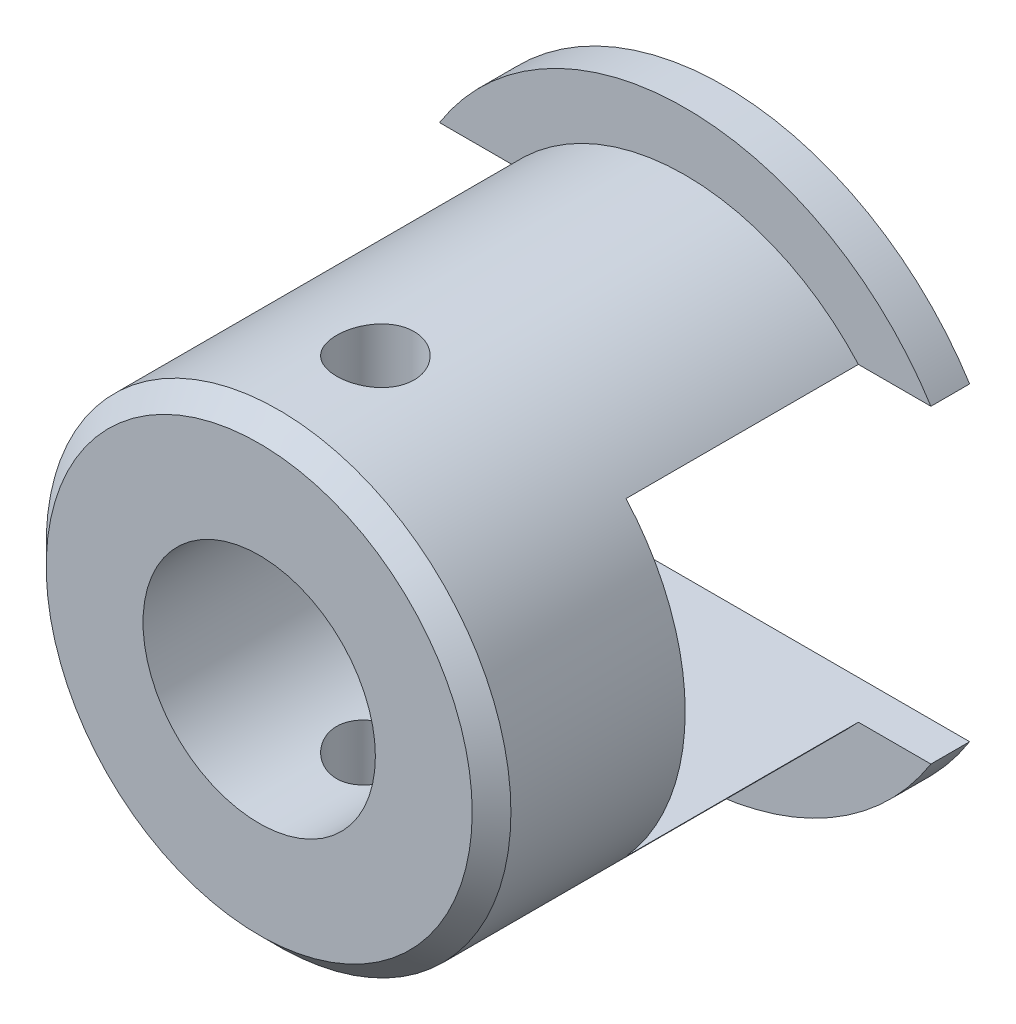
ISO-10303-21;
HEADER;
FILE_DESCRIPTION(('STEP AP214'),'2;1');
FILE_NAME('part.step','',(''),(''),'','','');
FILE_SCHEMA(('AUTOMOTIVE_DESIGN { 1 0 10303 214 1 1 1 1 }'));
ENDSEC;
DATA;
#1=APPLICATION_CONTEXT('core data for automotive mechanical design processes');
#2=APPLICATION_PROTOCOL_DEFINITION('international standard','automotive_design',2000,#1);
#3=PRODUCT_CONTEXT('',#1,'mechanical');
#4=PRODUCT('Part','Part','',(#3));
#5=PRODUCT_RELATED_PRODUCT_CATEGORY('part','',(#4));
#6=PRODUCT_DEFINITION_FORMATION('','',#4);
#7=PRODUCT_DEFINITION_CONTEXT('part definition',#1,'design');
#8=PRODUCT_DEFINITION('design','',#6,#7);
#9=PRODUCT_DEFINITION_SHAPE('','',#8);
#10=(LENGTH_UNIT() NAMED_UNIT(*) SI_UNIT(.MILLI.,.METRE.));
#11=(NAMED_UNIT(*) PLANE_ANGLE_UNIT() SI_UNIT($,.RADIAN.));
#12=(NAMED_UNIT(*) SI_UNIT($,.STERADIAN.) SOLID_ANGLE_UNIT());
#13=UNCERTAINTY_MEASURE_WITH_UNIT(LENGTH_MEASURE(1.E-05),#10,'distance_accuracy_value','');
#14=(GEOMETRIC_REPRESENTATION_CONTEXT(3) GLOBAL_UNCERTAINTY_ASSIGNED_CONTEXT((#13)) GLOBAL_UNIT_ASSIGNED_CONTEXT((#10,
#11,#12)) REPRESENTATION_CONTEXT('',''));
#15=CARTESIAN_POINT('',(0.,0.,0.));
#16=DIRECTION('',(0.,0.,1.));
#17=DIRECTION('',(1.,0.,0.));
#18=AXIS2_PLACEMENT_3D('',#15,#16,#17);
#19=CARTESIAN_POINT('',(0.,0.,1.));
#20=DIRECTION('',(0.,0.,1.));
#21=DIRECTION('',(1.,0.,0.));
#22=AXIS2_PLACEMENT_3D('',#19,#20,#21);
#23=CYLINDRICAL_SURFACE('',#22,6.);
#24=CARTESIAN_POINT('',(0.,0.,11.5));
#25=DIRECTION('',(0.,0.,1.));
#26=DIRECTION('',(1.,0.,0.));
#27=AXIS2_PLACEMENT_3D('',#24,#25,#26);
#28=CIRCLE('',#27,6.);
#29=CARTESIAN_POINT('',(6.,0.,11.5));
#30=VERTEX_POINT('',#29);
#31=EDGE_CURVE('E11',#30,#30,#28,.F.);
#32=ORIENTED_EDGE('',*,*,#31,.T.);
#33=EDGE_LOOP('',(#32));
#34=FACE_BOUND('',#33,.T.);
#35=CARTESIAN_POINT('',(0.,-6.,8.));
#36=CARTESIAN_POINT('',(-0.0557563619832847,-5.9999990446753,8.00000223557913));
#37=CARTESIAN_POINT('',(-0.111543152735527,-5.99921471165214,8.00467890998757));
#38=CARTESIAN_POINT('',(-0.221552088669216,-5.99616137976555,8.02325426350613));
#39=CARTESIAN_POINT('',(-0.275772747183698,-5.99389101569556,8.03716142276464));
#40=CARTESIAN_POINT('',(-0.381041898885056,-5.9881202729458,8.0737661794371));
#41=CARTESIAN_POINT('',(-0.432092947372759,-5.98462090063677,8.09645658625623));
#42=CARTESIAN_POINT('',(-0.529656736791177,-5.97677690832828,8.14996491682096));
#43=CARTESIAN_POINT('',(-0.576169995951436,-5.97243238501774,8.1807819109932));
#44=CARTESIAN_POINT('',(-0.663789045716671,-5.96333326983325,8.24998203352819));
#45=CARTESIAN_POINT('',(-0.704845161413986,-5.95857548725943,8.28842764585445));
#46=CARTESIAN_POINT('',(-0.779955399463971,-5.94921050750693,8.37165918738913));
#47=CARTESIAN_POINT('',(-0.814009079756388,-5.94460331985067,8.41644551658264));
#48=CARTESIAN_POINT('',(-0.874346850242053,-5.93603026303912,8.51142838647882));
#49=CARTESIAN_POINT('',(-0.9005818211444,-5.93206851636654,8.56165653472191));
#50=CARTESIAN_POINT('',(-0.944223346164487,-5.9252791591787,8.66588382572025));
#51=CARTESIAN_POINT('',(-0.961630496626245,-5.92245147205723,8.71988271347105));
#52=CARTESIAN_POINT('',(-0.986965751113923,-5.91828214737102,8.82959210994262));
#53=CARTESIAN_POINT('',(-0.99497961165416,-5.9169270739428,8.88528229460056));
#54=CARTESIAN_POINT('',(-1.00156669011595,-5.9158157557466,8.99723211075339));
#55=CARTESIAN_POINT('',(-1.0001405761556,-5.91605939782886,9.05349170166692));
#56=CARTESIAN_POINT('',(-0.98795803935846,-5.91810571545422,9.16437114451018));
#57=CARTESIAN_POINT('',(-0.977297952755909,-5.91989229327567,9.21900192141809));
#58=CARTESIAN_POINT('',(-0.947101256161378,-5.92479798084403,9.32568852713165));
#59=CARTESIAN_POINT('',(-0.927564341727896,-5.92791713629309,9.37774426755542));
#60=CARTESIAN_POINT('',(-0.880070898437565,-5.9351539173364,9.47809152937637));
#61=CARTESIAN_POINT('',(-0.852074365551885,-5.9392762684293,9.52636376243249));
#62=CARTESIAN_POINT('',(-0.788484807022972,-5.94805167366004,9.61756176021536));
#63=CARTESIAN_POINT('',(-0.752891168261713,-5.95270477061715,9.66048709298197));
#64=CARTESIAN_POINT('',(-0.67459288486362,-5.96208811151914,9.74033043432294));
#65=CARTESIAN_POINT('',(-0.63180558554925,-5.96681859692661,9.77716740741604));
#66=CARTESIAN_POINT('',(-0.540614099592658,-5.97577040558689,9.84315110506614));
#67=CARTESIAN_POINT('',(-0.492209876762568,-5.97999172555898,9.87229778007329));
#68=CARTESIAN_POINT('',(-0.391082366466683,-5.98745557157165,9.92208089085451));
#69=CARTESIAN_POINT('',(-0.338355490225864,-5.99069727362979,9.9427101677325));
#70=CARTESIAN_POINT('',(-0.230119338241092,-5.99583001205064,9.97479768609839));
#71=CARTESIAN_POINT('',(-0.174610295671786,-5.9977211614019,9.98625669478949));
#72=CARTESIAN_POINT('',(-0.0630839605206478,-5.99992451937074,9.99956854338445));
#73=CARTESIAN_POINT('',(-0.00708029486040275,-6.00025501205114,10.0015326287222));
#74=CARTESIAN_POINT('',(0.104455909155957,-5.99934989768468,9.99609546222875));
#75=CARTESIAN_POINT('',(0.159988465556817,-5.99811435089647,9.98869457074651));
#76=CARTESIAN_POINT('',(0.268662470218707,-5.99422730775281,9.96483006026581));
#77=CARTESIAN_POINT('',(0.321816347354153,-5.99158441920524,9.94842151664395));
#78=CARTESIAN_POINT('',(0.424618753944178,-5.98517785782144,9.90706619272019));
#79=CARTESIAN_POINT('',(0.474267086363889,-5.98141412204808,9.88211893294589));
#80=CARTESIAN_POINT('',(0.569132275787585,-5.97313806520963,9.82413955012129));
#81=CARTESIAN_POINT('',(0.614306100374862,-5.96861942354809,9.7910379375331));
#82=CARTESIAN_POINT('',(0.698497434201078,-5.9593538695676,9.71778507384598));
#83=CARTESIAN_POINT('',(0.737514495878635,-5.95460694068619,9.67763331068933));
#84=CARTESIAN_POINT('',(0.808697111863202,-5.94536070094338,9.59092098077143));
#85=CARTESIAN_POINT('',(0.840787504445488,-5.94086446454842,9.54429833379424));
#86=CARTESIAN_POINT('',(0.896680924117996,-5.93268611911154,9.44625881234458));
#87=CARTESIAN_POINT('',(0.920484213907931,-5.92900398426408,9.394842089909));
#88=CARTESIAN_POINT('',(0.959015332589261,-5.92289381479082,9.28888410687515));
#89=CARTESIAN_POINT('',(0.97378057301918,-5.92046061724426,9.2343567619878));
#90=CARTESIAN_POINT('',(0.993934181511312,-5.91711086734105,9.1235519483113));
#91=CARTESIAN_POINT('',(0.999323364778469,-5.91619418313089,9.06727463210718));
#92=CARTESIAN_POINT('',(1.00054914641894,-5.91598693233605,8.95531793361504));
#93=CARTESIAN_POINT('',(0.996504054450076,-5.9166762260226,8.89963984856989));
#94=CARTESIAN_POINT('',(0.979231935582741,-5.91955912581491,8.7897683007797));
#95=CARTESIAN_POINT('',(0.966004938444992,-5.92175272704486,8.73557483322325));
#96=CARTESIAN_POINT('',(0.930789795837963,-5.92738942512688,8.63025662508296));
#97=CARTESIAN_POINT('',(0.908811836240179,-5.93083106887868,8.57912839597759));
#98=CARTESIAN_POINT('',(0.856730801566366,-5.93857747568883,8.48126573232206));
#99=CARTESIAN_POINT('',(0.826627323499427,-5.9428822815536,8.43453151585115));
#100=CARTESIAN_POINT('',(0.758727553748864,-5.95193381618249,8.3461857667569));
#101=CARTESIAN_POINT('',(0.72084422543746,-5.95668518230521,8.30464159331989));
#102=CARTESIAN_POINT('',(0.638643612552093,-5.96605748944336,8.22845935821003));
#103=CARTESIAN_POINT('',(0.594324845165056,-5.97067840010619,8.19382289254473));
#104=CARTESIAN_POINT('',(0.500147667856114,-5.97930611856888,8.13222069272002));
#105=CARTESIAN_POINT('',(0.450253115013128,-5.98330846501242,8.10530958427482));
#106=CARTESIAN_POINT('',(0.346605227751593,-5.9902046704071,8.06029220615603));
#107=CARTESIAN_POINT('',(0.292855797932005,-5.99309963270993,8.04217716756812));
#108=CARTESIAN_POINT('',(0.199081324018161,-5.99682316333182,8.01919789034933));
#109=CARTESIAN_POINT('',(0.15962353211938,-5.99800810909344,8.01201021215362));
#110=CARTESIAN_POINT('',(0.0801157241279247,-5.99959686394448,8.0024105048621));
#111=CARTESIAN_POINT('',(0.0400657182433988,-6.00000068648257,7.99999839354506));
#112=CARTESIAN_POINT('',(0.,-6.,8.));
#113=B_SPLINE_CURVE_WITH_KNOTS('',3,(#35,#36,#37,#38,#39,#40,#41,#42,#43,#44,#45,#46,#47,#48,
#49,#50,#51,#52,#53,#54,#55,#56,#57,#58,#59,#60,#61,#62,#63,#64,#65,#66,#67,#68,#69,#70,#71,#72,
#73,#74,#75,#76,#77,#78,#79,#80,#81,#82,#83,#84,#85,#86,#87,#88,#89,#90,#91,#92,#93,#94,#95,#96,
#97,#98,#99,#100,#101,#102,#103,#104,#105,#106,#107,#108,#109,#110,#111,#112),.UNSPECIFIED.,.T.,
.F.,(4,2,2,2,2,2,2,2,2,2,2,2,2,2,2,2,2,2,2,2,2,2,2,2,2,2,2,2,2,2,2,2,2,2,2,2,2,2,4),(0.,
0.167122633975404,0.334399018278169,0.501538746810108,0.668659365069917,0.837209964249329,
1.00577120067943,1.17537008329536,1.34495750750473,1.5129843084137,1.68099921728355,
1.84728208704163,2.01357066010152,2.18065822653023,2.3477592827223,2.51693107964531,
2.68610396654339,2.85541875566361,3.0247193780846,3.19203153396559,3.35933725214344,
3.52563122802566,3.69193454330427,3.8597073025081,4.02749225221713,4.19701528803048,
4.36653294950377,4.53534408936709,4.70414055114647,4.8708316380908,5.03752218475253,
5.20401927290489,5.37052462011735,5.53900553677357,5.70752533551589,5.8772089264288,
6.04672300852029,6.16681699265608,6.28690890910787),.UNSPECIFIED.);
#114=CARTESIAN_POINT('',(0.,-6.,8.));
#115=VERTEX_POINT('',#114);
#116=EDGE_CURVE('E153',#115,#115,#113,.T.);
#117=ORIENTED_EDGE('',*,*,#116,.T.);
#118=EDGE_LOOP('',(#117));
#119=FACE_BOUND('',#118,.T.);
#120=DIRECTION('',(0.,0.,1.));
#121=VECTOR('',#120,1.);
#122=CARTESIAN_POINT('',(-4.47213595499958,-4.,1.));
#123=LINE('',#122,#121);
#124=CARTESIAN_POINT('',(-4.47213595499958,-4.,1.));
#125=VERTEX_POINT('',#124);
#126=CARTESIAN_POINT('',(-4.47213595499958,-4.,7.));
#127=VERTEX_POINT('',#126);
#128=EDGE_CURVE('E112',#125,#127,#123,.T.);
#129=ORIENTED_EDGE('',*,*,#128,.F.);
#130=CARTESIAN_POINT('',(0.,0.,1.));
#131=DIRECTION('',(0.,0.,1.));
#132=DIRECTION('',(1.,0.,0.));
#133=AXIS2_PLACEMENT_3D('',#130,#131,#132);
#134=CIRCLE('',#133,6.);
#135=CARTESIAN_POINT('',(4.47213595499958,-4.,1.));
#136=VERTEX_POINT('',#135);
#137=EDGE_CURVE('E117',#125,#136,#134,.T.);
#138=ORIENTED_EDGE('',*,*,#137,.T.);
#139=DIRECTION('',(0.,0.,1.));
#140=VECTOR('',#139,1.);
#141=CARTESIAN_POINT('',(4.47213595499958,-4.,1.));
#142=LINE('',#141,#140);
#143=CARTESIAN_POINT('',(4.47213595499958,-4.,7.));
#144=VERTEX_POINT('',#143);
#145=EDGE_CURVE('E110',#144,#136,#142,.F.);
#146=ORIENTED_EDGE('',*,*,#145,.F.);
#147=CARTESIAN_POINT('',(0.,0.,7.));
#148=DIRECTION('',(0.,0.,1.));
#149=DIRECTION('',(1.,0.,0.));
#150=AXIS2_PLACEMENT_3D('',#147,#148,#149);
#151=CIRCLE('',#150,6.);
#152=CARTESIAN_POINT('',(4.47213595499958,4.,7.));
#153=VERTEX_POINT('',#152);
#154=EDGE_CURVE('E97',#153,#144,#151,.F.);
#155=ORIENTED_EDGE('',*,*,#154,.F.);
#156=DIRECTION('',(0.,0.,1.));
#157=VECTOR('',#156,1.);
#158=CARTESIAN_POINT('',(4.47213595499958,4.,1.));
#159=LINE('',#158,#157);
#160=CARTESIAN_POINT('',(4.47213595499958,4.,1.));
#161=VERTEX_POINT('',#160);
#162=EDGE_CURVE('E119',#161,#153,#159,.T.);
#163=ORIENTED_EDGE('',*,*,#162,.F.);
#164=CARTESIAN_POINT('',(-4.47213595499958,4.,1.));
#165=VERTEX_POINT('',#164);
#166=EDGE_CURVE('E206',#161,#165,#134,.T.);
#167=ORIENTED_EDGE('',*,*,#166,.T.);
#168=DIRECTION('',(0.,0.,1.));
#169=VECTOR('',#168,1.);
#170=CARTESIAN_POINT('',(-4.47213595499958,4.,1.));
#171=LINE('',#170,#169);
#172=CARTESIAN_POINT('',(-4.47213595499958,4.,7.));
#173=VERTEX_POINT('',#172);
#174=EDGE_CURVE('E118',#173,#165,#171,.F.);
#175=ORIENTED_EDGE('',*,*,#174,.F.);
#176=EDGE_CURVE('E106',#127,#173,#151,.F.);
#177=ORIENTED_EDGE('',*,*,#176,.F.);
#178=EDGE_LOOP('',(#129,#138,#146,#155,#163,#167,#175,#177));
#179=FACE_BOUND('',#178,.T.);
#180=CARTESIAN_POINT('',(0.,6.,8.));
#181=CARTESIAN_POINT('',(0.0557563619832869,5.9999990446753,8.00000223557913));
#182=CARTESIAN_POINT('',(0.111543152735529,5.99921471165214,8.00467890998757));
#183=CARTESIAN_POINT('',(0.221552088669218,5.99616137976555,8.02325426350613));
#184=CARTESIAN_POINT('',(0.2757727471837,5.99389101569556,8.03716142276464));
#185=CARTESIAN_POINT('',(0.381041898885059,5.9881202729458,8.0737661794371));
#186=CARTESIAN_POINT('',(0.432092947372762,5.98462090063677,8.09645658625623));
#187=CARTESIAN_POINT('',(0.52965673679118,5.97677690832828,8.14996491682096));
#188=CARTESIAN_POINT('',(0.576169995951438,5.97243238501774,8.1807819109932));
#189=CARTESIAN_POINT('',(0.663789045716674,5.96333326983325,8.24998203352819));
#190=CARTESIAN_POINT('',(0.704845161413989,5.95857548725943,8.28842764585445));
#191=CARTESIAN_POINT('',(0.779955399463973,5.94921050750693,8.37165918738913));
#192=CARTESIAN_POINT('',(0.81400907975639,5.94460331985067,8.41644551658264));
#193=CARTESIAN_POINT('',(0.874346850242055,5.93603026303912,8.51142838647882));
#194=CARTESIAN_POINT('',(0.900581821144402,5.93206851636655,8.56165653472191));
#195=CARTESIAN_POINT('',(0.944223346164489,5.9252791591787,8.66588382572025));
#196=CARTESIAN_POINT('',(0.961630496626247,5.92245147205723,8.71988271347105));
#197=CARTESIAN_POINT('',(0.986965751113925,5.91828214737102,8.82959210994262));
#198=CARTESIAN_POINT('',(0.994979611654162,5.9169270739428,8.88528229460056));
#199=CARTESIAN_POINT('',(1.00156669011595,5.9158157557466,8.99723211075339));
#200=CARTESIAN_POINT('',(1.0001405761556,5.91605939782886,9.05349170166692));
#201=CARTESIAN_POINT('',(0.987958039358462,5.91810571545422,9.16437114451018));
#202=CARTESIAN_POINT('',(0.977297952755911,5.91989229327567,9.21900192141809));
#203=CARTESIAN_POINT('',(0.94710125616138,5.92479798084403,9.32568852713165));
#204=CARTESIAN_POINT('',(0.927564341727898,5.92791713629309,9.37774426755542));
#205=CARTESIAN_POINT('',(0.880070898437567,5.9351539173364,9.47809152937637));
#206=CARTESIAN_POINT('',(0.852074365551887,5.9392762684293,9.52636376243249));
#207=CARTESIAN_POINT('',(0.788484807022975,5.94805167366004,9.61756176021536));
#208=CARTESIAN_POINT('',(0.752891168261716,5.95270477061714,9.66048709298197));
#209=CARTESIAN_POINT('',(0.674592884863622,5.96208811151914,9.74033043432294));
#210=CARTESIAN_POINT('',(0.631805585549252,5.96681859692661,9.77716740741604));
#211=CARTESIAN_POINT('',(0.54061409959266,5.97577040558689,9.84315110506614));
#212=CARTESIAN_POINT('',(0.49220987676257,5.97999172555898,9.87229778007329));
#213=CARTESIAN_POINT('',(0.391082366466685,5.98745557157165,9.92208089085451));
#214=CARTESIAN_POINT('',(0.338355490225865,5.99069727362979,9.9427101677325));
#215=CARTESIAN_POINT('',(0.230119338241093,5.99583001205064,9.97479768609839));
#216=CARTESIAN_POINT('',(0.174610295671788,5.9977211614019,9.98625669478949));
#217=CARTESIAN_POINT('',(0.0630839605206501,5.99992451937074,9.99956854338446));
#218=CARTESIAN_POINT('',(0.00708029486040501,6.00025501205114,10.0015326287222));
#219=CARTESIAN_POINT('',(-0.104455909155954,5.99934989768468,9.99609546222875));
#220=CARTESIAN_POINT('',(-0.159988465556815,5.99811435089647,9.98869457074651));
#221=CARTESIAN_POINT('',(-0.268662470218705,5.99422730775281,9.96483006026581));
#222=CARTESIAN_POINT('',(-0.321816347354151,5.99158441920525,9.94842151664395));
#223=CARTESIAN_POINT('',(-0.424618753944176,5.98517785782144,9.90706619272019));
#224=CARTESIAN_POINT('',(-0.474267086363887,5.98141412204808,9.88211893294589));
#225=CARTESIAN_POINT('',(-0.569132275787582,5.97313806520963,9.82413955012129));
#226=CARTESIAN_POINT('',(-0.614306100374859,5.96861942354809,9.7910379375331));
#227=CARTESIAN_POINT('',(-0.698497434201075,5.9593538695676,9.71778507384598));
#228=CARTESIAN_POINT('',(-0.737514495878633,5.95460694068619,9.67763331068933));
#229=CARTESIAN_POINT('',(-0.8086971118632,5.94536070094338,9.59092098077143));
#230=CARTESIAN_POINT('',(-0.840787504445485,5.94086446454842,9.54429833379424));
#231=CARTESIAN_POINT('',(-0.896680924117993,5.93268611911154,9.44625881234458));
#232=CARTESIAN_POINT('',(-0.920484213907928,5.92900398426408,9.394842089909));
#233=CARTESIAN_POINT('',(-0.959015332589259,5.92289381479082,9.28888410687515));
#234=CARTESIAN_POINT('',(-0.973780573019178,5.92046061724426,9.2343567619878));
#235=CARTESIAN_POINT('',(-0.99393418151131,5.91711086734104,9.1235519483113));
#236=CARTESIAN_POINT('',(-0.999323364778466,5.91619418313089,9.06727463210718));
#237=CARTESIAN_POINT('',(-1.00054914641894,5.91598693233605,8.95531793361504));
#238=CARTESIAN_POINT('',(-0.996504054450074,5.9166762260226,8.89963984856989));
#239=CARTESIAN_POINT('',(-0.979231935582739,5.91955912581491,8.7897683007797));
#240=CARTESIAN_POINT('',(-0.96600493844499,5.92175272704486,8.73557483322325));
#241=CARTESIAN_POINT('',(-0.93078979583796,5.92738942512688,8.63025662508296));
#242=CARTESIAN_POINT('',(-0.908811836240177,5.93083106887868,8.57912839597759));
#243=CARTESIAN_POINT('',(-0.856730801566364,5.93857747568883,8.48126573232206));
#244=CARTESIAN_POINT('',(-0.826627323499425,5.9428822815536,8.43453151585115));
#245=CARTESIAN_POINT('',(-0.758727553748861,5.95193381618249,8.3461857667569));
#246=CARTESIAN_POINT('',(-0.720844225437458,5.95668518230521,8.30464159331989));
#247=CARTESIAN_POINT('',(-0.638643612552091,5.96605748944337,8.22845935821003));
#248=CARTESIAN_POINT('',(-0.594324845165054,5.97067840010619,8.19382289254473));
#249=CARTESIAN_POINT('',(-0.500147667856112,5.97930611856888,8.13222069272002));
#250=CARTESIAN_POINT('',(-0.450253115013126,5.98330846501242,8.10530958427482));
#251=CARTESIAN_POINT('',(-0.346605227751591,5.9902046704071,8.06029220615603));
#252=CARTESIAN_POINT('',(-0.292855797932003,5.99309963270993,8.04217716756812));
#253=CARTESIAN_POINT('',(-0.199081324018159,5.99682316333182,8.01919789034933));
#254=CARTESIAN_POINT('',(-0.159623532119378,5.99800810909344,8.01201021215362));
#255=CARTESIAN_POINT('',(-0.0801157241279224,5.99959686394448,8.0024105048621));
#256=CARTESIAN_POINT('',(-0.0400657182433965,6.00000068648257,7.99999839354506));
#257=CARTESIAN_POINT('',(0.,6.,8.));
#258=B_SPLINE_CURVE_WITH_KNOTS('',3,(#180,#181,#182,#183,#184,#185,#186,#187,#188,#189,#190,
#191,#192,#193,#194,#195,#196,#197,#198,#199,#200,#201,#202,#203,#204,#205,#206,#207,#208,#209,
#210,#211,#212,#213,#214,#215,#216,#217,#218,#219,#220,#221,#222,#223,#224,#225,#226,#227,#228,
#229,#230,#231,#232,#233,#234,#235,#236,#237,#238,#239,#240,#241,#242,#243,#244,#245,#246,#247,
#248,#249,#250,#251,#252,#253,#254,#255,#256,#257),.UNSPECIFIED.,.T.,.F.,(4,2,2,2,2,2,2,2,2,2,2,
2,2,2,2,2,2,2,2,2,2,2,2,2,2,2,2,2,2,2,2,2,2,2,2,2,2,2,4),(0.,0.167122633975404,
0.334399018278169,0.501538746810109,0.668659365069917,0.837209964249329,1.00577120067943,
1.17537008329536,1.34495750750473,1.5129843084137,1.68099921728355,1.84728208704163,
2.01357066010152,2.18065822653023,2.3477592827223,2.51693107964531,2.68610396654339,
2.85541875566362,3.0247193780846,3.19203153396559,3.35933725214344,3.52563122802566,
3.69193454330427,3.8597073025081,4.02749225221713,4.19701528803048,4.36653294950378,
4.53534408936709,4.70414055114647,4.8708316380908,5.03752218475253,5.20401927290489,
5.37052462011735,5.53900553677357,5.7075253355159,5.8772089264288,6.04672300852029,
6.16681699265608,6.28690890910788),.UNSPECIFIED.);
#259=CARTESIAN_POINT('',(0.,6.,8.));
#260=VERTEX_POINT('',#259);
#261=EDGE_CURVE('E157',#260,#260,#258,.T.);
#262=ORIENTED_EDGE('',*,*,#261,.T.);
#263=EDGE_LOOP('',(#262));
#264=FACE_BOUND('',#263,.T.);
#265=ADVANCED_FACE('F33',(#34,#119,#179,#264),#23,.T.);
#266=CARTESIAN_POINT('',(0.,0.,7.));
#267=DIRECTION('',(0.,0.,1.));
#268=DIRECTION('',(1.,0.,0.));
#269=AXIS2_PLACEMENT_3D('',#266,#267,#268);
#270=CYLINDRICAL_SURFACE('',#269,3.);
#271=CARTESIAN_POINT('',(0.,0.,7.));
#272=DIRECTION('',(0.,0.,1.));
#273=DIRECTION('',(1.,0.,0.));
#274=AXIS2_PLACEMENT_3D('',#271,#272,#273);
#275=CIRCLE('',#274,3.);
#276=CARTESIAN_POINT('',(3.,0.,7.));
#277=VERTEX_POINT('',#276);
#278=EDGE_CURVE('E107',#277,#277,#275,.F.);
#279=ORIENTED_EDGE('',*,*,#278,.T.);
#280=EDGE_LOOP('',(#279));
#281=FACE_BOUND('',#280,.T.);
#282=CARTESIAN_POINT('',(0.,0.,12.));
#283=DIRECTION('',(0.,0.,1.));
#284=DIRECTION('',(1.,0.,0.));
#285=AXIS2_PLACEMENT_3D('',#282,#283,#284);
#286=CIRCLE('',#285,3.);
#287=CARTESIAN_POINT('',(3.,0.,12.));
#288=VERTEX_POINT('',#287);
#289=EDGE_CURVE('E235',#288,#288,#286,.T.);
#290=ORIENTED_EDGE('',*,*,#289,.T.);
#291=EDGE_LOOP('',(#290));
#292=FACE_BOUND('',#291,.T.);
#293=CARTESIAN_POINT('',(0.,-3.,8.));
#294=CARTESIAN_POINT('',(-0.0545633628867222,-3.00000015300943,7.99999974626836));
#295=CARTESIAN_POINT('',(-0.109125194538549,-2.99849769507545,8.00448026612722));
#296=CARTESIAN_POINT('',(-0.216641760872971,-2.99265210203281,8.02222910881722));
#297=CARTESIAN_POINT('',(-0.269596328118817,-2.98830867202153,8.03549834394892));
#298=CARTESIAN_POINT('',(-0.372332789501776,-2.97725307906443,8.07031924338405));
#299=CARTESIAN_POINT('',(-0.422119825886034,-2.97054487730853,8.09185706245927));
#300=CARTESIAN_POINT('',(-0.517374936805324,-2.95544445717342,8.14254117283835));
#301=CARTESIAN_POINT('',(-0.562842156958705,-2.94705190667778,8.1716889650026));
#302=CARTESIAN_POINT('',(-0.649741675022265,-2.92914094443005,8.23782580485875));
#303=CARTESIAN_POINT('',(-0.691003700298309,-2.91959556463785,8.2750312342605));
#304=CARTESIAN_POINT('',(-0.766832692702083,-2.90060314783122,8.35576715470657));
#305=CARTESIAN_POINT('',(-0.801398185489462,-2.89115613290549,8.39929903492851));
#306=CARTESIAN_POINT('',(-0.863824942227859,-2.87313332477274,8.49298511519646));
#307=CARTESIAN_POINT('',(-0.891464858221032,-2.86459039275688,8.54329373973212));
#308=CARTESIAN_POINT('',(-0.937818873877721,-2.84975305418601,8.64817609445855));
#309=CARTESIAN_POINT('',(-0.956535697386765,-2.84345796160746,8.70274851716275));
#310=CARTESIAN_POINT('',(-0.983873461509163,-2.83411303269377,8.81267322149671));
#311=CARTESIAN_POINT('',(-0.992813448271769,-2.83096095769611,8.86793720848907));
#312=CARTESIAN_POINT('',(-1.00134112333448,-2.82795656629508,8.97926375415588));
#313=CARTESIAN_POINT('',(-1.00093170160472,-2.8281032302273,9.03532606070919));
#314=CARTESIAN_POINT('',(-0.991019903703418,-2.8315901500818,9.14393663044402));
#315=CARTESIAN_POINT('',(-0.981933913166994,-2.83478415867533,9.19652840291902));
#316=CARTESIAN_POINT('',(-0.955606162849416,-2.84376657724551,9.29939341960684));
#317=CARTESIAN_POINT('',(-0.93836342659187,-2.84955529784108,9.34966638543507));
#318=CARTESIAN_POINT('',(-0.89593905806021,-2.86317911131249,9.44741274959148));
#319=CARTESIAN_POINT('',(-0.870634048707261,-2.87104565793117,9.49482802546953));
#320=CARTESIAN_POINT('',(-0.812889106303138,-2.88792558575726,9.58487090827973));
#321=CARTESIAN_POINT('',(-0.780447112364004,-2.89693929790464,9.62749712693338));
#322=CARTESIAN_POINT('',(-0.707349332682236,-2.91567329167741,9.70909159816078));
#323=CARTESIAN_POINT('',(-0.66635315007631,-2.92540589354843,9.74775269450907));
#324=CARTESIAN_POINT('',(-0.578339569970062,-2.94406938387037,9.8177312666634));
#325=CARTESIAN_POINT('',(-0.531321595660813,-2.95300019538067,9.8490480381645));
#326=CARTESIAN_POINT('',(-0.431947613046266,-2.96917107937794,9.90369630023507));
#327=CARTESIAN_POINT('',(-0.379543276416335,-2.9763935000804,9.92694549134073));
#328=CARTESIAN_POINT('',(-0.271269083364506,-2.98820567144435,9.96420317395571));
#329=CARTESIAN_POINT('',(-0.215400438154953,-2.99279633654879,9.97821487542344));
#330=CARTESIAN_POINT('',(-0.104383829529303,-2.99867627071441,9.99605566602236));
#331=CARTESIAN_POINT('',(-0.0493095998648441,-3.00010001833731,10.0002998091727));
#332=CARTESIAN_POINT('',(0.0607750699602378,-2.99988902694825,9.99966732640153));
#333=CARTESIAN_POINT('',(0.115785519319649,-2.99825480419352,9.99479224002013));
#334=CARTESIAN_POINT('',(0.222519866304261,-2.99220024717114,9.97638809226404));
#335=CARTESIAN_POINT('',(0.274292806834858,-2.98786198711228,9.96311379395048));
#336=CARTESIAN_POINT('',(0.374855958579562,-2.97691846830034,9.9286065555333));
#337=CARTESIAN_POINT('',(0.423645788508561,-2.97031292046541,9.90737260053233));
#338=CARTESIAN_POINT('',(0.518288296393324,-2.95528931287427,9.8569295681591));
#339=CARTESIAN_POINT('',(0.564029959217332,-2.94682814756305,9.8275254067164));
#340=CARTESIAN_POINT('',(0.650064830135407,-2.92905253915743,9.76180584998695));
#341=CARTESIAN_POINT('',(0.690356367794896,-2.91973783591888,9.72548834396984));
#342=CARTESIAN_POINT('',(0.766252507807016,-2.90076847982472,9.64502124899174));
#343=CARTESIAN_POINT('',(0.801560969248494,-2.89111761095155,9.60059077306675));
#344=CARTESIAN_POINT('',(0.864257522320856,-2.87299973286981,9.5062284321955));
#345=CARTESIAN_POINT('',(0.891645547920845,-2.8645327335312,9.4562965213898));
#346=CARTESIAN_POINT('',(0.937596930423362,-2.84982391820308,9.35232698469341));
#347=CARTESIAN_POINT('',(0.956178132197767,-2.84357760900632,9.29829792075722));
#348=CARTESIAN_POINT('',(0.983894666792164,-2.83410832399133,9.18762134987585));
#349=CARTESIAN_POINT('',(0.993034254961245,-2.83088398622698,9.13097503456694));
#350=CARTESIAN_POINT('',(1.00127628247038,-2.82797858875071,9.01980290398679));
#351=CARTESIAN_POINT('',(1.00087025731093,-2.82812400344299,8.96531765974826));
#352=CARTESIAN_POINT('',(0.991242293454879,-2.8315126992356,8.85723492510026));
#353=CARTESIAN_POINT('',(0.982020879458888,-2.83475579595884,8.80363738204709));
#354=CARTESIAN_POINT('',(0.955371813126982,-2.84384524278943,8.69986433698733));
#355=CARTESIAN_POINT('',(0.938103346014881,-2.84964098015514,8.64964317499277));
#356=CARTESIAN_POINT('',(0.895979365760383,-2.86316398825434,8.55277259306447));
#357=CARTESIAN_POINT('',(0.871122168553981,-2.87089168765297,8.50612396881274));
#358=CARTESIAN_POINT('',(0.813260692583251,-2.8878282922406,8.41551633007631));
#359=CARTESIAN_POINT('',(0.779948242764534,-2.89708711641604,8.37176349810141));
#360=CARTESIAN_POINT('',(0.706642883135699,-2.91583356283786,8.29031018661601));
#361=CARTESIAN_POINT('',(0.666648084451496,-2.92532124912518,8.25261142431198));
#362=CARTESIAN_POINT('',(0.579241556920675,-2.94390030525393,8.18285558771076));
#363=CARTESIAN_POINT('',(0.531601513499726,-2.95296181801216,8.15107565224898));
#364=CARTESIAN_POINT('',(0.43135735740663,-2.96925991172652,8.09600957114937));
#365=CARTESIAN_POINT('',(0.37875451813235,-2.9764969590794,8.07272125407796));
#366=CARTESIAN_POINT('',(0.272493647200976,-2.98805515068532,8.03627836751132));
#367=CARTESIAN_POINT('',(0.21898775767641,-2.9924921242252,8.02271753373662));
#368=CARTESIAN_POINT('',(0.110320416010249,-2.99846407064225,8.00457971932287));
#369=CARTESIAN_POINT('',(0.0551594255687477,-2.99999984531906,8.00000025650346));
#370=CARTESIAN_POINT('',(0.,-3.,8.));
#371=B_SPLINE_CURVE_WITH_KNOTS('',3,(#293,#294,#295,#296,#297,#298,#299,#300,#301,#302,#303,
#304,#305,#306,#307,#308,#309,#310,#311,#312,#313,#314,#315,#316,#317,#318,#319,#320,#321,#322,
#323,#324,#325,#326,#327,#328,#329,#330,#331,#332,#333,#334,#335,#336,#337,#338,#339,#340,#341,
#342,#343,#344,#345,#346,#347,#348,#349,#350,#351,#352,#353,#354,#355,#356,#357,#358,#359,#360,
#361,#362,#363,#364,#365,#366,#367,#368,#369,#370),.UNSPECIFIED.,.T.,.F.,(4,2,2,2,2,2,2,2,2,2,2,
2,2,2,2,2,2,2,2,2,2,2,2,2,2,2,2,2,2,2,2,2,2,2,2,2,2,2,4),(0.,0.163487106026011,
0.326991185267521,0.490222672870274,0.653486377799101,0.821846842827561,0.990244332875303,
1.16348384823471,1.33667044692833,1.5040192574184,1.67131633987485,1.8309682655128,
1.99063930855482,2.15288171155131,2.31517102558207,2.48593305811367,2.65671145966618,
2.82918405650358,3.00159668877208,3.1665358317517,3.33144713164177,3.49158157978214,
3.65173645284104,3.81610399843737,3.98052180821892,4.15241022880752,4.32430008234997,
4.49584013824417,4.66730284700846,4.82995666056619,4.99260079341186,5.15215587070228,
5.31174638165788,5.47830066681615,5.64490211113589,5.81799660824911,5.99104681142267,
6.15636558363624,6.3216386602795),.UNSPECIFIED.);
#372=CARTESIAN_POINT('',(0.,-3.,8.));
#373=VERTEX_POINT('',#372);
#374=EDGE_CURVE('E127',#373,#373,#371,.T.);
#375=ORIENTED_EDGE('',*,*,#374,.F.);
#376=EDGE_LOOP('',(#375));
#377=FACE_BOUND('',#376,.T.);
#378=CARTESIAN_POINT('',(0.,3.,8.));
#379=CARTESIAN_POINT('',(0.0545633628867244,3.00000015300943,7.99999974626836));
#380=CARTESIAN_POINT('',(0.109125194538551,2.99849769507545,8.00448026612722));
#381=CARTESIAN_POINT('',(0.216641760872973,2.99265210203281,8.02222910881722));
#382=CARTESIAN_POINT('',(0.269596328118819,2.98830867202153,8.03549834394892));
#383=CARTESIAN_POINT('',(0.372332789501778,2.97725307906443,8.07031924338405));
#384=CARTESIAN_POINT('',(0.422119825886036,2.97054487730853,8.09185706245927));
#385=CARTESIAN_POINT('',(0.517374936805326,2.95544445717342,8.14254117283835));
#386=CARTESIAN_POINT('',(0.562842156958707,2.94705190667778,8.1716889650026));
#387=CARTESIAN_POINT('',(0.649741675022268,2.92914094443005,8.23782580485875));
#388=CARTESIAN_POINT('',(0.691003700298311,2.91959556463785,8.2750312342605));
#389=CARTESIAN_POINT('',(0.766832692702086,2.90060314783121,8.35576715470657));
#390=CARTESIAN_POINT('',(0.801398185489464,2.89115613290549,8.39929903492851));
#391=CARTESIAN_POINT('',(0.863824942227861,2.87313332477274,8.49298511519646));
#392=CARTESIAN_POINT('',(0.891464858221034,2.86459039275688,8.54329373973212));
#393=CARTESIAN_POINT('',(0.937818873877723,2.84975305418601,8.64817609445855));
#394=CARTESIAN_POINT('',(0.956535697386767,2.84345796160746,8.70274851716275));
#395=CARTESIAN_POINT('',(0.983873461509165,2.83411303269377,8.81267322149671));
#396=CARTESIAN_POINT('',(0.992813448271771,2.83096095769611,8.86793720848907));
#397=CARTESIAN_POINT('',(1.00134112333448,2.82795656629508,8.97926375415588));
#398=CARTESIAN_POINT('',(1.00093170160472,2.8281032302273,9.03532606070919));
#399=CARTESIAN_POINT('',(0.99101990370342,2.8315901500818,9.14393663044402));
#400=CARTESIAN_POINT('',(0.981933913166996,2.83478415867533,9.19652840291902));
#401=CARTESIAN_POINT('',(0.955606162849418,2.84376657724551,9.29939341960684));
#402=CARTESIAN_POINT('',(0.938363426591872,2.84955529784108,9.34966638543507));
#403=CARTESIAN_POINT('',(0.895939058060212,2.86317911131249,9.44741274959148));
#404=CARTESIAN_POINT('',(0.870634048707263,2.87104565793117,9.49482802546953));
#405=CARTESIAN_POINT('',(0.81288910630314,2.88792558575726,9.58487090827973));
#406=CARTESIAN_POINT('',(0.780447112364007,2.89693929790464,9.62749712693338));
#407=CARTESIAN_POINT('',(0.70734933268224,2.91567329167741,9.70909159816077));
#408=CARTESIAN_POINT('',(0.666353150076313,2.92540589354843,9.74775269450907));
#409=CARTESIAN_POINT('',(0.578339569970066,2.94406938387037,9.8177312666634));
#410=CARTESIAN_POINT('',(0.531321595660816,2.95300019538067,9.8490480381645));
#411=CARTESIAN_POINT('',(0.431947613046269,2.96917107937794,9.90369630023507));
#412=CARTESIAN_POINT('',(0.379543276416338,2.97639350008039,9.92694549134073));
#413=CARTESIAN_POINT('',(0.271269083364509,2.98820567144435,9.96420317395571));
#414=CARTESIAN_POINT('',(0.215400438154955,2.99279633654879,9.97821487542344));
#415=CARTESIAN_POINT('',(0.104383829529305,2.99867627071441,9.99605566602236));
#416=CARTESIAN_POINT('',(0.0493095998648467,3.00010001833731,10.0002998091728));
#417=CARTESIAN_POINT('',(-0.0607750699602352,2.99988902694825,9.99966732640153));
#418=CARTESIAN_POINT('',(-0.115785519319646,2.99825480419352,9.99479224002013));
#419=CARTESIAN_POINT('',(-0.222519866304258,2.99220024717114,9.97638809226404));
#420=CARTESIAN_POINT('',(-0.274292806834855,2.98786198711228,9.96311379395048));
#421=CARTESIAN_POINT('',(-0.37485595857956,2.97691846830034,9.9286065555333));
#422=CARTESIAN_POINT('',(-0.423645788508558,2.97031292046541,9.90737260053233));
#423=CARTESIAN_POINT('',(-0.51828829639332,2.95528931287427,9.8569295681591));
#424=CARTESIAN_POINT('',(-0.564029959217328,2.94682814756305,9.8275254067164));
#425=CARTESIAN_POINT('',(-0.650064830135402,2.92905253915743,9.76180584998695));
#426=CARTESIAN_POINT('',(-0.690356367794892,2.91973783591888,9.72548834396984));
#427=CARTESIAN_POINT('',(-0.766252507807012,2.90076847982472,9.64502124899174));
#428=CARTESIAN_POINT('',(-0.80156096924849,2.89111761095156,9.60059077306675));
#429=CARTESIAN_POINT('',(-0.864257522320852,2.87299973286981,9.5062284321955));
#430=CARTESIAN_POINT('',(-0.891645547920842,2.8645327335312,9.4562965213898));
#431=CARTESIAN_POINT('',(-0.93759693042336,2.84982391820308,9.35232698469341));
#432=CARTESIAN_POINT('',(-0.956178132197765,2.84357760900632,9.29829792075722));
#433=CARTESIAN_POINT('',(-0.983894666792162,2.83410832399133,9.18762134987585));
#434=CARTESIAN_POINT('',(-0.993034254961243,2.83088398622698,9.13097503456694));
#435=CARTESIAN_POINT('',(-1.00127628247038,2.82797858875071,9.01980290398679));
#436=CARTESIAN_POINT('',(-1.00087025731093,2.82812400344299,8.96531765974826));
#437=CARTESIAN_POINT('',(-0.991242293454877,2.8315126992356,8.85723492510026));
#438=CARTESIAN_POINT('',(-0.982020879458886,2.83475579595884,8.80363738204709));
#439=CARTESIAN_POINT('',(-0.955371813126979,2.84384524278944,8.69986433698733));
#440=CARTESIAN_POINT('',(-0.938103346014879,2.84964098015514,8.64964317499277));
#441=CARTESIAN_POINT('',(-0.895979365760381,2.86316398825434,8.55277259306447));
#442=CARTESIAN_POINT('',(-0.871122168553979,2.87089168765297,8.50612396881274));
#443=CARTESIAN_POINT('',(-0.813260692583249,2.8878282922406,8.41551633007631));
#444=CARTESIAN_POINT('',(-0.779948242764532,2.89708711641604,8.37176349810141));
#445=CARTESIAN_POINT('',(-0.706642883135697,2.91583356283786,8.29031018661601));
#446=CARTESIAN_POINT('',(-0.666648084451494,2.92532124912518,8.25261142431198));
#447=CARTESIAN_POINT('',(-0.579241556920673,2.94390030525393,8.18285558771076));
#448=CARTESIAN_POINT('',(-0.531601513499724,2.95296181801216,8.15107565224899));
#449=CARTESIAN_POINT('',(-0.431357357406627,2.96925991172653,8.09600957114937));
#450=CARTESIAN_POINT('',(-0.378754518132348,2.9764969590794,8.07272125407796));
#451=CARTESIAN_POINT('',(-0.272493647200974,2.98805515068532,8.03627836751132));
#452=CARTESIAN_POINT('',(-0.218987757676407,2.9924921242252,8.02271753373662));
#453=CARTESIAN_POINT('',(-0.110320416010246,2.99846407064225,8.00457971932287));
#454=CARTESIAN_POINT('',(-0.0551594255687453,2.99999984531906,8.00000025650346));
#455=CARTESIAN_POINT('',(0.,3.,8.));
#456=B_SPLINE_CURVE_WITH_KNOTS('',3,(#378,#379,#380,#381,#382,#383,#384,#385,#386,#387,#388,
#389,#390,#391,#392,#393,#394,#395,#396,#397,#398,#399,#400,#401,#402,#403,#404,#405,#406,#407,
#408,#409,#410,#411,#412,#413,#414,#415,#416,#417,#418,#419,#420,#421,#422,#423,#424,#425,#426,
#427,#428,#429,#430,#431,#432,#433,#434,#435,#436,#437,#438,#439,#440,#441,#442,#443,#444,#445,
#446,#447,#448,#449,#450,#451,#452,#453,#454,#455),.UNSPECIFIED.,.T.,.F.,(4,2,2,2,2,2,2,2,2,2,2,
2,2,2,2,2,2,2,2,2,2,2,2,2,2,2,2,2,2,2,2,2,2,2,2,2,2,2,4),(0.,0.163487106026011,
0.326991185267521,0.490222672870274,0.653486377799101,0.821846842827561,0.990244332875303,
1.16348384823471,1.33667044692833,1.5040192574184,1.67131633987485,1.8309682655128,
1.99063930855482,2.15288171155131,2.31517102558207,2.48593305811367,2.65671145966618,
2.82918405650358,3.00159668877208,3.1665358317517,3.33144713164177,3.49158157978214,
3.65173645284104,3.81610399843736,3.98052180821891,4.15241022880752,4.32430008234997,
4.49584013824417,4.66730284700846,4.82995666056619,4.99260079341185,5.15215587070228,
5.31174638165788,5.47830066681615,5.64490211113589,5.81799660824911,5.99104681142266,
6.15636558363624,6.3216386602795),.UNSPECIFIED.);
#457=CARTESIAN_POINT('',(0.,3.,8.));
#458=VERTEX_POINT('',#457);
#459=EDGE_CURVE('E134',#458,#458,#456,.T.);
#460=ORIENTED_EDGE('',*,*,#459,.F.);
#461=EDGE_LOOP('',(#460));
#462=FACE_BOUND('',#461,.T.);
#463=ADVANCED_FACE('F137',(#281,#292,#377,#462),#270,.F.);
#464=CARTESIAN_POINT('',(0.,0.,12.));
#465=DIRECTION('',(0.,0.,-1.));
#466=DIRECTION('',(-1.,0.,0.));
#467=AXIS2_PLACEMENT_3D('',#464,#465,#466);
#468=CYLINDRICAL_SURFACE('',#467,7.5);
#469=CARTESIAN_POINT('',(0.,0.,1.));
#470=DIRECTION('',(0.,0.,1.));
#471=DIRECTION('',(1.,0.,0.));
#472=AXIS2_PLACEMENT_3D('',#469,#470,#471);
#473=CIRCLE('',#472,7.5);
#474=CARTESIAN_POINT('',(-6.34428877022476,-4.,1.));
#475=VERTEX_POINT('',#474);
#476=CARTESIAN_POINT('',(6.34428877022476,-4.,1.));
#477=VERTEX_POINT('',#476);
#478=EDGE_CURVE('E199',#475,#477,#473,.T.);
#479=ORIENTED_EDGE('',*,*,#478,.F.);
#480=DIRECTION('',(0.,0.,-1.));
#481=VECTOR('',#480,1.);
#482=CARTESIAN_POINT('',(-6.34428877022476,-4.,12.));
#483=LINE('',#482,#481);
#484=CARTESIAN_POINT('',(-6.34428877022476,-4.,0.));
#485=VERTEX_POINT('',#484);
#486=EDGE_CURVE('E201',#475,#485,#483,.T.);
#487=ORIENTED_EDGE('',*,*,#486,.T.);
#488=CARTESIAN_POINT('',(0.,0.,0.));
#489=DIRECTION('',(0.,0.,1.));
#490=DIRECTION('',(1.,0.,0.));
#491=AXIS2_PLACEMENT_3D('',#488,#489,#490);
#492=CIRCLE('',#491,7.5);
#493=CARTESIAN_POINT('',(6.34428877022476,-4.,0.));
#494=VERTEX_POINT('',#493);
#495=EDGE_CURVE('E209',#485,#494,#492,.T.);
#496=ORIENTED_EDGE('',*,*,#495,.T.);
#497=DIRECTION('',(0.,0.,-1.));
#498=VECTOR('',#497,1.);
#499=CARTESIAN_POINT('',(6.34428877022476,-4.,12.));
#500=LINE('',#499,#498);
#501=EDGE_CURVE('E203',#494,#477,#500,.F.);
#502=ORIENTED_EDGE('',*,*,#501,.T.);
#503=EDGE_LOOP('',(#479,#487,#496,#502));
#504=FACE_BOUND('',#503,.T.);
#505=ADVANCED_FACE('F182',(#504),#468,.T.);
#506=CARTESIAN_POINT('',(0.,0.,0.));
#507=DIRECTION('',(0.,0.,1.));
#508=DIRECTION('',(1.,0.,0.));
#509=AXIS2_PLACEMENT_3D('',#506,#507,#508);
#510=PLANE('',#509);
#511=ORIENTED_EDGE('',*,*,#495,.F.);
#512=DIRECTION('',(-1.,0.,0.));
#513=VECTOR('',#512,1.);
#514=CARTESIAN_POINT('',(9.88481106110358,-4.,0.));
#515=LINE('',#514,#513);
#516=EDGE_CURVE('E218',#494,#485,#515,.T.);
#517=ORIENTED_EDGE('',*,*,#516,.F.);
#518=EDGE_LOOP('',(#511,#517));
#519=FACE_BOUND('',#518,.T.);
#520=ADVANCED_FACE('F179',(#519),#510,.F.);
#521=CARTESIAN_POINT('',(0.,0.,1.));
#522=DIRECTION('',(0.,0.,1.));
#523=DIRECTION('',(1.,0.,0.));
#524=AXIS2_PLACEMENT_3D('',#521,#522,#523);
#525=PLANE('',#524);
#526=DIRECTION('',(1.,0.,0.));
#527=VECTOR('',#526,1.);
#528=CARTESIAN_POINT('',(0.,-4.,1.));
#529=LINE('',#528,#527);
#530=EDGE_CURVE('E232',#475,#125,#529,.T.);
#531=ORIENTED_EDGE('',*,*,#530,.F.);
#532=ORIENTED_EDGE('',*,*,#478,.T.);
#533=EDGE_CURVE('E56',#136,#477,#529,.T.);
#534=ORIENTED_EDGE('',*,*,#533,.F.);
#535=ORIENTED_EDGE('',*,*,#137,.F.);
#536=EDGE_LOOP('',(#531,#532,#534,#535));
#537=FACE_BOUND('',#536,.T.);
#538=ADVANCED_FACE('F172',(#537),#525,.T.);
#539=CARTESIAN_POINT('',(6.34428877022476,4.,1.));
#540=VERTEX_POINT('',#539);
#541=CARTESIAN_POINT('',(-6.34428877022476,4.,1.));
#542=VERTEX_POINT('',#541);
#543=EDGE_CURVE('E205',#540,#542,#473,.T.);
#544=ORIENTED_EDGE('',*,*,#543,.F.);
#545=DIRECTION('',(0.,0.,-1.));
#546=VECTOR('',#545,1.);
#547=CARTESIAN_POINT('',(6.34428877022476,4.,12.));
#548=LINE('',#547,#546);
#549=CARTESIAN_POINT('',(6.34428877022476,4.,0.));
#550=VERTEX_POINT('',#549);
#551=EDGE_CURVE('E227',#540,#550,#548,.T.);
#552=ORIENTED_EDGE('',*,*,#551,.T.);
#553=CARTESIAN_POINT('',(-6.34428877022476,4.,0.));
#554=VERTEX_POINT('',#553);
#555=EDGE_CURVE('E122',#550,#554,#492,.T.);
#556=ORIENTED_EDGE('',*,*,#555,.T.);
#557=DIRECTION('',(0.,0.,-1.));
#558=VECTOR('',#557,1.);
#559=CARTESIAN_POINT('',(-6.34428877022476,4.,12.));
#560=LINE('',#559,#558);
#561=EDGE_CURVE('E230',#554,#542,#560,.F.);
#562=ORIENTED_EDGE('',*,*,#561,.T.);
#563=EDGE_LOOP('',(#544,#552,#556,#562));
#564=FACE_BOUND('',#563,.T.);
#565=ADVANCED_FACE('F177',(#564),#468,.T.);
#566=ORIENTED_EDGE('',*,*,#555,.F.);
#567=DIRECTION('',(1.,0.,0.));
#568=VECTOR('',#567,1.);
#569=CARTESIAN_POINT('',(9.88481106110358,4.,0.));
#570=LINE('',#569,#568);
#571=EDGE_CURVE('E219',#554,#550,#570,.T.);
#572=ORIENTED_EDGE('',*,*,#571,.F.);
#573=EDGE_LOOP('',(#566,#572));
#574=FACE_BOUND('',#573,.T.);
#575=ADVANCED_FACE('F170',(#574),#510,.F.);
#576=DIRECTION('',(-1.,0.,0.));
#577=VECTOR('',#576,1.);
#578=CARTESIAN_POINT('',(0.,4.,1.));
#579=LINE('',#578,#577);
#580=EDGE_CURVE('E225',#540,#161,#579,.T.);
#581=ORIENTED_EDGE('',*,*,#580,.F.);
#582=ORIENTED_EDGE('',*,*,#543,.T.);
#583=EDGE_CURVE('E228',#165,#542,#579,.T.);
#584=ORIENTED_EDGE('',*,*,#583,.F.);
#585=ORIENTED_EDGE('',*,*,#166,.F.);
#586=EDGE_LOOP('',(#581,#582,#584,#585));
#587=FACE_BOUND('',#586,.T.);
#588=ADVANCED_FACE('F165',(#587),#525,.T.);
#589=CARTESIAN_POINT('',(0.,0.,12.));
#590=DIRECTION('',(0.,0.,1.));
#591=DIRECTION('',(1.,0.,0.));
#592=AXIS2_PLACEMENT_3D('',#589,#590,#591);
#593=PLANE('',#592);
#594=CARTESIAN_POINT('',(0.,0.,12.));
#595=DIRECTION('',(0.,0.,1.));
#596=DIRECTION('',(1.,0.,0.));
#597=AXIS2_PLACEMENT_3D('',#594,#595,#596);
#598=CIRCLE('',#597,5.5);
#599=CARTESIAN_POINT('',(5.5,0.,12.));
#600=VERTEX_POINT('',#599);
#601=EDGE_CURVE('E41',#600,#600,#598,.T.);
#602=ORIENTED_EDGE('',*,*,#601,.T.);
#603=EDGE_LOOP('',(#602));
#604=FACE_BOUND('',#603,.T.);
#605=ORIENTED_EDGE('',*,*,#289,.F.);
#606=EDGE_LOOP('',(#605));
#607=FACE_BOUND('',#606,.T.);
#608=ADVANCED_FACE('F169',(#604,#607),#593,.T.);
#609=CARTESIAN_POINT('',(9.88481106110358,-4.,7.));
#610=DIRECTION('',(0.,-1.,0.));
#611=DIRECTION('',(0.,0.,-1.));
#612=AXIS2_PLACEMENT_3D('',#609,#610,#611);
#613=PLANE('',#612);
#614=ORIENTED_EDGE('',*,*,#516,.T.);
#615=ORIENTED_EDGE('',*,*,#486,.F.);
#616=ORIENTED_EDGE('',*,*,#530,.T.);
#617=ORIENTED_EDGE('',*,*,#128,.T.);
#618=DIRECTION('',(-1.,0.,0.));
#619=VECTOR('',#618,1.);
#620=CARTESIAN_POINT('',(9.88481106110358,-4.,7.));
#621=LINE('',#620,#619);
#622=EDGE_CURVE('E101',#144,#127,#621,.T.);
#623=ORIENTED_EDGE('',*,*,#622,.F.);
#624=ORIENTED_EDGE('',*,*,#145,.T.);
#625=ORIENTED_EDGE('',*,*,#533,.T.);
#626=ORIENTED_EDGE('',*,*,#501,.F.);
#627=EDGE_LOOP('',(#614,#615,#616,#617,#623,#624,#625,#626));
#628=FACE_BOUND('',#627,.T.);
#629=ADVANCED_FACE('F109',(#628),#613,.F.);
#630=CARTESIAN_POINT('',(9.88481106110358,4.,7.));
#631=DIRECTION('',(0.,1.,0.));
#632=DIRECTION('',(0.,0.,1.));
#633=AXIS2_PLACEMENT_3D('',#630,#631,#632);
#634=PLANE('',#633);
#635=ORIENTED_EDGE('',*,*,#571,.T.);
#636=ORIENTED_EDGE('',*,*,#551,.F.);
#637=ORIENTED_EDGE('',*,*,#580,.T.);
#638=ORIENTED_EDGE('',*,*,#162,.T.);
#639=DIRECTION('',(1.,0.,0.));
#640=VECTOR('',#639,1.);
#641=CARTESIAN_POINT('',(9.88481106110358,4.,7.));
#642=LINE('',#641,#640);
#643=EDGE_CURVE('E48',#173,#153,#642,.T.);
#644=ORIENTED_EDGE('',*,*,#643,.F.);
#645=ORIENTED_EDGE('',*,*,#174,.T.);
#646=ORIENTED_EDGE('',*,*,#583,.T.);
#647=ORIENTED_EDGE('',*,*,#561,.F.);
#648=EDGE_LOOP('',(#635,#636,#637,#638,#644,#645,#646,#647));
#649=FACE_BOUND('',#648,.T.);
#650=ADVANCED_FACE('F252',(#649),#634,.F.);
#651=CARTESIAN_POINT('',(0.,0.,7.));
#652=DIRECTION('',(0.,0.,1.));
#653=DIRECTION('',(1.,0.,0.));
#654=AXIS2_PLACEMENT_3D('',#651,#652,#653);
#655=PLANE('',#654);
#656=ORIENTED_EDGE('',*,*,#176,.T.);
#657=ORIENTED_EDGE('',*,*,#643,.T.);
#658=ORIENTED_EDGE('',*,*,#154,.T.);
#659=ORIENTED_EDGE('',*,*,#622,.T.);
#660=EDGE_LOOP('',(#656,#657,#658,#659));
#661=FACE_BOUND('',#660,.T.);
#662=ORIENTED_EDGE('',*,*,#278,.F.);
#663=EDGE_LOOP('',(#662));
#664=FACE_BOUND('',#663,.T.);
#665=ADVANCED_FACE('F99',(#661,#664),#655,.F.);
#666=CARTESIAN_POINT('',(0.,7.,9.));
#667=DIRECTION('',(0.,-1.,0.));
#668=DIRECTION('',(0.,0.,-1.));
#669=AXIS2_PLACEMENT_3D('',#666,#667,#668);
#670=CYLINDRICAL_SURFACE('',#669,1.);
#671=ORIENTED_EDGE('',*,*,#116,.F.);
#672=EDGE_LOOP('',(#671));
#673=FACE_BOUND('',#672,.T.);
#674=ORIENTED_EDGE('',*,*,#374,.T.);
#675=EDGE_LOOP('',(#674));
#676=FACE_BOUND('',#675,.T.);
#677=ADVANCED_FACE('F145',(#673,#676),#670,.F.);
#678=ORIENTED_EDGE('',*,*,#261,.F.);
#679=EDGE_LOOP('',(#678));
#680=FACE_BOUND('',#679,.T.);
#681=ORIENTED_EDGE('',*,*,#459,.T.);
#682=EDGE_LOOP('',(#681));
#683=FACE_BOUND('',#682,.T.);
#684=ADVANCED_FACE('F141',(#680,#683),#670,.F.);
#685=CARTESIAN_POINT('',(0.,0.,12.));
#686=DIRECTION('',(0.,0.,-1.));
#687=DIRECTION('',(-1.,0.,0.));
#688=AXIS2_PLACEMENT_3D('',#685,#686,#687);
#689=CONICAL_SURFACE('',#688,5.5,0.785398163397447);
#690=ORIENTED_EDGE('',*,*,#31,.F.);
#691=EDGE_LOOP('',(#690));
#692=FACE_BOUND('',#691,.T.);
#693=ORIENTED_EDGE('',*,*,#601,.F.);
#694=EDGE_LOOP('',(#693));
#695=FACE_BOUND('',#694,.T.);
#696=ADVANCED_FACE('F35',(#692,#695),#689,.T.);
#697=CLOSED_SHELL('',(#265,#463,#505,#520,#538,#565,#575,#588,#608,#629,#650,#665,#677,#684,#696));
#698=MANIFOLD_SOLID_BREP('B2',#697);
#699=ADVANCED_BREP_SHAPE_REPRESENTATION('',(#18,#698),#14);
#700=SHAPE_DEFINITION_REPRESENTATION(#9,#699);
ENDSEC;
END-ISO-10303-21;
